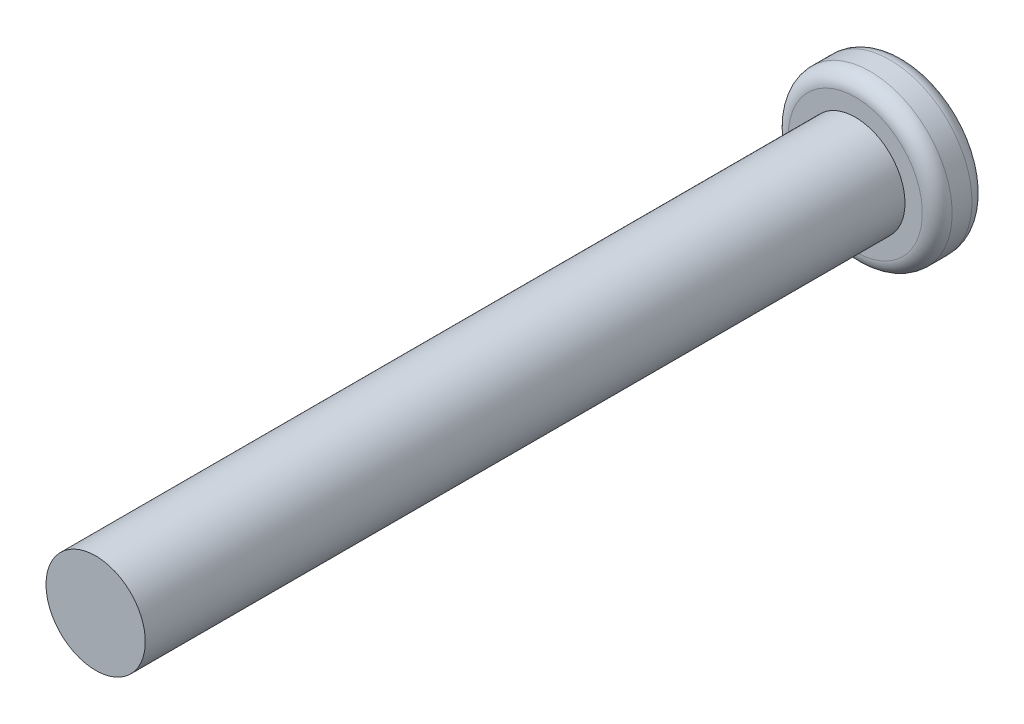
ISO-10303-21;
HEADER;
FILE_DESCRIPTION(('STEP AP214'),'2;1');
FILE_NAME('part.step','',(''),(''),'','','');
FILE_SCHEMA(('AUTOMOTIVE_DESIGN { 1 0 10303 214 1 1 1 1 }'));
ENDSEC;
DATA;
#1=APPLICATION_CONTEXT('core data for automotive mechanical design processes');
#2=APPLICATION_PROTOCOL_DEFINITION('international standard','automotive_design',2000,#1);
#3=PRODUCT_CONTEXT('',#1,'mechanical');
#4=PRODUCT('Part','Part','',(#3));
#5=PRODUCT_RELATED_PRODUCT_CATEGORY('part','',(#4));
#6=PRODUCT_DEFINITION_FORMATION('','',#4);
#7=PRODUCT_DEFINITION_CONTEXT('part definition',#1,'design');
#8=PRODUCT_DEFINITION('design','',#6,#7);
#9=PRODUCT_DEFINITION_SHAPE('','',#8);
#10=(LENGTH_UNIT() NAMED_UNIT(*) SI_UNIT(.MILLI.,.METRE.));
#11=(NAMED_UNIT(*) PLANE_ANGLE_UNIT() SI_UNIT($,.RADIAN.));
#12=(NAMED_UNIT(*) SI_UNIT($,.STERADIAN.) SOLID_ANGLE_UNIT());
#13=UNCERTAINTY_MEASURE_WITH_UNIT(LENGTH_MEASURE(1.E-05),#10,'distance_accuracy_value','');
#14=(GEOMETRIC_REPRESENTATION_CONTEXT(3) GLOBAL_UNCERTAINTY_ASSIGNED_CONTEXT((#13)) GLOBAL_UNIT_ASSIGNED_CONTEXT((#10,
#11,#12)) REPRESENTATION_CONTEXT('',''));
#15=CARTESIAN_POINT('',(0.,0.,0.));
#16=DIRECTION('',(0.,0.,1.));
#17=DIRECTION('',(1.,0.,0.));
#18=AXIS2_PLACEMENT_3D('',#15,#16,#17);
#19=CARTESIAN_POINT('',(0.,0.,223.));
#20=DIRECTION('',(0.,0.,-1.));
#21=DIRECTION('',(-1.,0.,0.));
#22=AXIS2_PLACEMENT_3D('',#19,#20,#21);
#23=CYLINDRICAL_SURFACE('',#22,10.);
#24=CARTESIAN_POINT('',(0.,0.,223.));
#25=DIRECTION('',(0.,0.,-1.));
#26=DIRECTION('',(-1.,0.,0.));
#27=AXIS2_PLACEMENT_3D('',#24,#25,#26);
#28=CIRCLE('',#27,10.);
#29=CARTESIAN_POINT('',(-10.,0.,223.));
#30=VERTEX_POINT('',#29);
#31=EDGE_CURVE('E10',#30,#30,#28,.T.);
#32=ORIENTED_EDGE('',*,*,#31,.T.);
#33=EDGE_LOOP('',(#32));
#34=FACE_BOUND('',#33,.T.);
#35=CARTESIAN_POINT('',(0.,0.,70.));
#36=DIRECTION('',(0.,0.,-1.));
#37=DIRECTION('',(-1.,0.,0.));
#38=AXIS2_PLACEMENT_3D('',#35,#36,#37);
#39=CIRCLE('',#38,10.);
#40=CARTESIAN_POINT('',(-10.,0.,70.));
#41=VERTEX_POINT('',#40);
#42=EDGE_CURVE('E76',#41,#41,#39,.T.);
#43=ORIENTED_EDGE('',*,*,#42,.F.);
#44=EDGE_LOOP('',(#43));
#45=FACE_BOUND('',#44,.T.);
#46=ADVANCED_FACE('F41',(#34,#45),#23,.T.);
#47=CARTESIAN_POINT('',(10.,0.,223.));
#48=DIRECTION('',(0.,0.,1.));
#49=DIRECTION('',(1.,0.,0.));
#50=AXIS2_PLACEMENT_3D('',#47,#48,#49);
#51=PLANE('',#50);
#52=ORIENTED_EDGE('',*,*,#31,.F.);
#53=EDGE_LOOP('',(#52));
#54=FACE_BOUND('',#53,.T.);
#55=ADVANCED_FACE('F85',(#54),#51,.T.);
#56=CARTESIAN_POINT('',(0.,0.,63.));
#57=DIRECTION('',(0.,0.,-1.));
#58=DIRECTION('',(-1.,0.,0.));
#59=AXIS2_PLACEMENT_3D('',#56,#57,#58);
#60=PLANE('',#59);
#61=CARTESIAN_POINT('',(0.,0.,63.));
#62=DIRECTION('',(0.,0.,-1.));
#63=DIRECTION('',(-1.,0.,0.));
#64=AXIS2_PLACEMENT_3D('',#61,#62,#63);
#65=CIRCLE('',#64,10.);
#66=CARTESIAN_POINT('',(-10.,0.,63.));
#67=VERTEX_POINT('',#66);
#68=EDGE_CURVE('E48',#67,#67,#65,.T.);
#69=ORIENTED_EDGE('',*,*,#68,.T.);
#70=EDGE_LOOP('',(#69));
#71=FACE_BOUND('',#70,.T.);
#72=ADVANCED_FACE('F89',(#71),#60,.T.);
#73=CARTESIAN_POINT('',(0.,0.,63.));
#74=DIRECTION('',(0.,0.,-1.));
#75=DIRECTION('',(-1.,0.,0.));
#76=AXIS2_PLACEMENT_3D('',#73,#74,#75);
#77=TOROIDAL_SURFACE('',#76,13.,3.);
#78=CARTESIAN_POINT('',(0.,0.,60.));
#79=DIRECTION('',(0.,0.,-1.));
#80=DIRECTION('',(-1.,0.,0.));
#81=AXIS2_PLACEMENT_3D('',#78,#79,#80);
#82=CIRCLE('',#81,13.);
#83=CARTESIAN_POINT('',(-13.,0.,60.));
#84=VERTEX_POINT('',#83);
#85=EDGE_CURVE('E53',#84,#84,#82,.T.);
#86=ORIENTED_EDGE('',*,*,#85,.T.);
#87=EDGE_LOOP('',(#86));
#88=FACE_BOUND('',#87,.T.);
#89=ORIENTED_EDGE('',*,*,#68,.F.);
#90=EDGE_LOOP('',(#89));
#91=FACE_BOUND('',#90,.T.);
#92=ADVANCED_FACE('F94',(#88,#91),#77,.T.);
#93=CARTESIAN_POINT('',(13.,0.,60.));
#94=DIRECTION('',(0.,0.,-1.));
#95=DIRECTION('',(-1.,0.,0.));
#96=AXIS2_PLACEMENT_3D('',#93,#94,#95);
#97=PLANE('',#96);
#98=CARTESIAN_POINT('',(0.,0.,60.));
#99=DIRECTION('',(0.,0.,-1.));
#100=DIRECTION('',(-1.,0.,0.));
#101=AXIS2_PLACEMENT_3D('',#98,#99,#100);
#102=CIRCLE('',#101,13.5);
#103=CARTESIAN_POINT('',(-13.5,0.,60.));
#104=VERTEX_POINT('',#103);
#105=EDGE_CURVE('E58',#104,#104,#102,.T.);
#106=ORIENTED_EDGE('',*,*,#105,.T.);
#107=EDGE_LOOP('',(#106));
#108=FACE_BOUND('',#107,.T.);
#109=ORIENTED_EDGE('',*,*,#85,.F.);
#110=EDGE_LOOP('',(#109));
#111=FACE_BOUND('',#110,.T.);
#112=ADVANCED_FACE('F99',(#108,#111),#97,.T.);
#113=CARTESIAN_POINT('',(0.,0.,63.));
#114=DIRECTION('',(0.,0.,-1.));
#115=DIRECTION('',(-1.,0.,0.));
#116=AXIS2_PLACEMENT_3D('',#113,#114,#115);
#117=TOROIDAL_SURFACE('',#116,13.5,3.);
#118=CARTESIAN_POINT('',(0.,0.,63.));
#119=DIRECTION('',(0.,0.,-1.));
#120=DIRECTION('',(-1.,0.,0.));
#121=AXIS2_PLACEMENT_3D('',#118,#119,#120);
#122=CIRCLE('',#121,16.5);
#123=CARTESIAN_POINT('',(-16.5,0.,63.));
#124=VERTEX_POINT('',#123);
#125=EDGE_CURVE('E64',#124,#124,#122,.T.);
#126=ORIENTED_EDGE('',*,*,#125,.T.);
#127=EDGE_LOOP('',(#126));
#128=FACE_BOUND('',#127,.T.);
#129=ORIENTED_EDGE('',*,*,#105,.F.);
#130=EDGE_LOOP('',(#129));
#131=FACE_BOUND('',#130,.T.);
#132=ADVANCED_FACE('F103',(#128,#131),#117,.T.);
#133=CARTESIAN_POINT('',(0.,0.,223.));
#134=DIRECTION('',(0.,0.,-1.));
#135=DIRECTION('',(-1.,0.,0.));
#136=AXIS2_PLACEMENT_3D('',#133,#134,#135);
#137=CYLINDRICAL_SURFACE('',#136,16.5);
#138=CARTESIAN_POINT('',(0.,0.,67.));
#139=DIRECTION('',(0.,0.,-1.));
#140=DIRECTION('',(-1.,0.,0.));
#141=AXIS2_PLACEMENT_3D('',#138,#139,#140);
#142=CIRCLE('',#141,16.5);
#143=CARTESIAN_POINT('',(-16.5,0.,67.));
#144=VERTEX_POINT('',#143);
#145=EDGE_CURVE('E68',#144,#144,#142,.T.);
#146=ORIENTED_EDGE('',*,*,#145,.T.);
#147=EDGE_LOOP('',(#146));
#148=FACE_BOUND('',#147,.T.);
#149=ORIENTED_EDGE('',*,*,#125,.F.);
#150=EDGE_LOOP('',(#149));
#151=FACE_BOUND('',#150,.T.);
#152=ADVANCED_FACE('F107',(#148,#151),#137,.T.);
#153=CARTESIAN_POINT('',(0.,0.,67.));
#154=DIRECTION('',(0.,0.,-1.));
#155=DIRECTION('',(-1.,0.,0.));
#156=AXIS2_PLACEMENT_3D('',#153,#154,#155);
#157=TOROIDAL_SURFACE('',#156,13.5,3.);
#158=CARTESIAN_POINT('',(0.,0.,70.));
#159=DIRECTION('',(0.,0.,-1.));
#160=DIRECTION('',(-1.,0.,0.));
#161=AXIS2_PLACEMENT_3D('',#158,#159,#160);
#162=CIRCLE('',#161,13.5);
#163=CARTESIAN_POINT('',(-13.5,0.,70.));
#164=VERTEX_POINT('',#163);
#165=EDGE_CURVE('E72',#164,#164,#162,.T.);
#166=ORIENTED_EDGE('',*,*,#165,.T.);
#167=EDGE_LOOP('',(#166));
#168=FACE_BOUND('',#167,.T.);
#169=ORIENTED_EDGE('',*,*,#145,.F.);
#170=EDGE_LOOP('',(#169));
#171=FACE_BOUND('',#170,.T.);
#172=ADVANCED_FACE('F111',(#168,#171),#157,.T.);
#173=CARTESIAN_POINT('',(13.5,0.,70.));
#174=DIRECTION('',(0.,0.,1.));
#175=DIRECTION('',(1.,0.,0.));
#176=AXIS2_PLACEMENT_3D('',#173,#174,#175);
#177=PLANE('',#176);
#178=ORIENTED_EDGE('',*,*,#42,.T.);
#179=EDGE_LOOP('',(#178));
#180=FACE_BOUND('',#179,.T.);
#181=ORIENTED_EDGE('',*,*,#165,.F.);
#182=EDGE_LOOP('',(#181));
#183=FACE_BOUND('',#182,.T.);
#184=ADVANCED_FACE('F81',(#180,#183),#177,.T.);
#185=CLOSED_SHELL('',(#46,#55,#72,#92,#112,#132,#152,#172,#184));
#186=MANIFOLD_SOLID_BREP('B2',#185);
#187=ADVANCED_BREP_SHAPE_REPRESENTATION('',(#18,#186),#14);
#188=SHAPE_DEFINITION_REPRESENTATION(#9,#187);
ENDSEC;
END-ISO-10303-21;
